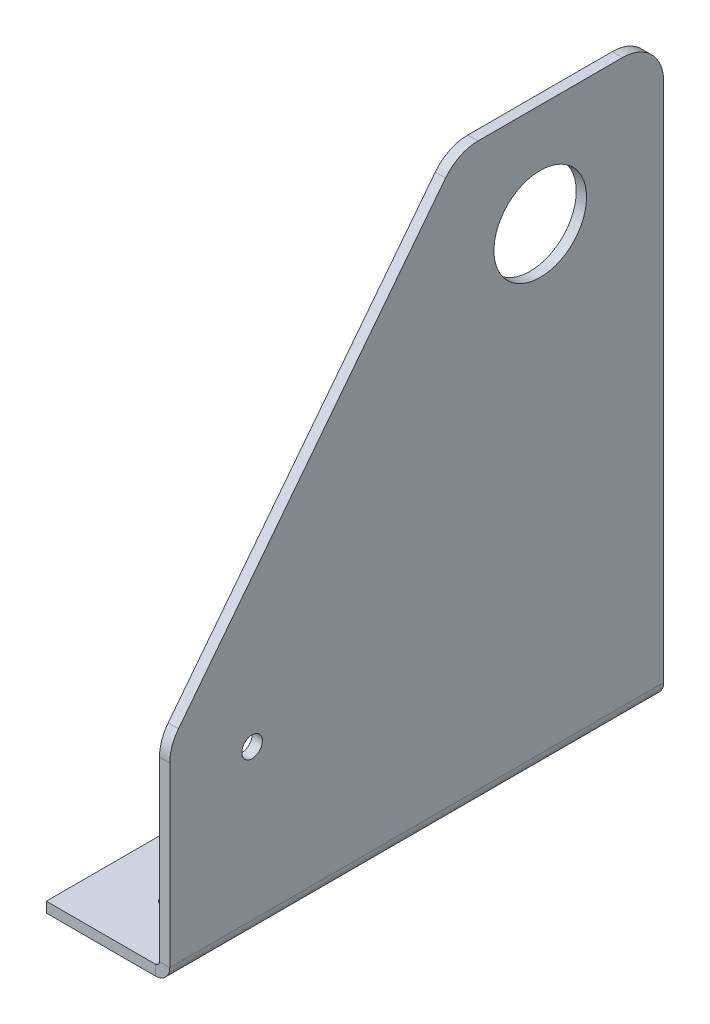
ISO-10303-21;
HEADER;
FILE_DESCRIPTION(('STEP AP214'),'2;1');
FILE_NAME('part.step','',(''),(''),'','','');
FILE_SCHEMA(('AUTOMOTIVE_DESIGN { 1 0 10303 214 1 1 1 1 }'));
ENDSEC;
DATA;
#1=APPLICATION_CONTEXT('core data for automotive mechanical design processes');
#2=APPLICATION_PROTOCOL_DEFINITION('international standard','automotive_design',2000,#1);
#3=PRODUCT_CONTEXT('',#1,'mechanical');
#4=PRODUCT('Part','Part','',(#3));
#5=PRODUCT_RELATED_PRODUCT_CATEGORY('part','',(#4));
#6=PRODUCT_DEFINITION_FORMATION('','',#4);
#7=PRODUCT_DEFINITION_CONTEXT('part definition',#1,'design');
#8=PRODUCT_DEFINITION('design','',#6,#7);
#9=PRODUCT_DEFINITION_SHAPE('','',#8);
#10=(LENGTH_UNIT() NAMED_UNIT(*) SI_UNIT(.MILLI.,.METRE.));
#11=(NAMED_UNIT(*) PLANE_ANGLE_UNIT() SI_UNIT($,.RADIAN.));
#12=(NAMED_UNIT(*) SI_UNIT($,.STERADIAN.) SOLID_ANGLE_UNIT());
#13=UNCERTAINTY_MEASURE_WITH_UNIT(LENGTH_MEASURE(1.E-05),#10,'distance_accuracy_value','');
#14=(GEOMETRIC_REPRESENTATION_CONTEXT(3) GLOBAL_UNCERTAINTY_ASSIGNED_CONTEXT((#13)) GLOBAL_UNIT_ASSIGNED_CONTEXT((#10,
#11,#12)) REPRESENTATION_CONTEXT('',''));
#15=CARTESIAN_POINT('',(0.,0.,0.));
#16=DIRECTION('',(0.,0.,1.));
#17=DIRECTION('',(1.,0.,0.));
#18=AXIS2_PLACEMENT_3D('',#15,#16,#17);
#19=CARTESIAN_POINT('',(-3.175,0.,76.2));
#20=DIRECTION('',(0.,0.,1.));
#21=DIRECTION('',(0.,-1.,0.));
#22=AXIS2_PLACEMENT_3D('',#19,#20,#21);
#23=PLANE('',#22);
#24=DIRECTION('',(-1.,0.,0.));
#25=VECTOR('',#24,1.);
#26=CARTESIAN_POINT('',(-3.175,4.44500000000002,76.2));
#27=LINE('',#26,#25);
#28=CARTESIAN_POINT('',(0.,4.44500000000001,76.2));
#29=VERTEX_POINT('',#28);
#30=CARTESIAN_POINT('',(-3.175,4.44500000000002,76.2));
#31=VERTEX_POINT('',#30);
#32=EDGE_CURVE('E11',#29,#31,#27,.T.);
#33=ORIENTED_EDGE('',*,*,#32,.F.);
#34=DIRECTION('',(0.,1.,0.));
#35=VECTOR('',#34,1.);
#36=CARTESIAN_POINT('',(0.,59.1425315732014,76.2));
#37=LINE('',#36,#35);
#38=CARTESIAN_POINT('',(0.,59.1425315732013,76.2));
#39=VERTEX_POINT('',#38);
#40=EDGE_CURVE('E97',#39,#29,#37,.F.);
#41=ORIENTED_EDGE('',*,*,#40,.F.);
#42=DIRECTION('',(-1.,0.,0.));
#43=VECTOR('',#42,1.);
#44=CARTESIAN_POINT('',(-3.175,59.1425315732013,76.2));
#45=LINE('',#44,#43);
#46=CARTESIAN_POINT('',(-3.175,59.1425315732013,76.2));
#47=VERTEX_POINT('',#46);
#48=EDGE_CURVE('E46',#39,#47,#45,.T.);
#49=ORIENTED_EDGE('',*,*,#48,.T.);
#50=DIRECTION('',(0.,-1.,0.));
#51=VECTOR('',#50,1.);
#52=CARTESIAN_POINT('',(-3.175,0.,76.2));
#53=LINE('',#52,#51);
#54=EDGE_CURVE('E99',#47,#31,#53,.T.);
#55=ORIENTED_EDGE('',*,*,#54,.T.);
#56=EDGE_LOOP('',(#33,#41,#49,#55));
#57=FACE_BOUND('',#56,.T.);
#58=ADVANCED_FACE('F36',(#57),#23,.T.);
#59=CARTESIAN_POINT('',(-3.175,59.1425315732014,63.5));
#60=DIRECTION('',(1.,0.,0.));
#61=DIRECTION('',(0.,0.,-1.));
#62=AXIS2_PLACEMENT_3D('',#59,#60,#61);
#63=CYLINDRICAL_SURFACE('',#62,12.7);
#64=ORIENTED_EDGE('',*,*,#48,.F.);
#65=CARTESIAN_POINT('',(0.,59.1425315732014,63.5));
#66=DIRECTION('',(1.,0.,0.));
#67=DIRECTION('',(0.,0.,-1.));
#68=AXIS2_PLACEMENT_3D('',#65,#66,#67);
#69=CIRCLE('',#68,12.7);
#70=CARTESIAN_POINT('',(0.,66.9395773648409,73.5247731606793));
#71=VERTEX_POINT('',#70);
#72=EDGE_CURVE('E124',#71,#39,#69,.T.);
#73=ORIENTED_EDGE('',*,*,#72,.F.);
#74=DIRECTION('',(-1.,0.,0.));
#75=VECTOR('',#74,1.);
#76=CARTESIAN_POINT('',(-3.175,66.9395773648409,73.5247731606793));
#77=LINE('',#76,#75);
#78=CARTESIAN_POINT('',(-3.175,66.9395773648409,73.5247731606793));
#79=VERTEX_POINT('',#78);
#80=EDGE_CURVE('E163',#71,#79,#77,.T.);
#81=ORIENTED_EDGE('',*,*,#80,.T.);
#82=CARTESIAN_POINT('',(-3.175,59.1425315732014,63.5));
#83=DIRECTION('',(1.,0.,0.));
#84=DIRECTION('',(0.,0.,-1.));
#85=AXIS2_PLACEMENT_3D('',#82,#83,#84);
#86=CIRCLE('',#85,12.7);
#87=EDGE_CURVE('E176',#79,#47,#86,.T.);
#88=ORIENTED_EDGE('',*,*,#87,.T.);
#89=EDGE_LOOP('',(#64,#73,#81,#88));
#90=FACE_BOUND('',#89,.T.);
#91=ADVANCED_FACE('F182',(#90),#63,.T.);
#92=CARTESIAN_POINT('',(-3.175,66.9395773648409,73.5247731606793));
#93=DIRECTION('',(0.,0.61394061351492,0.789352217376326));
#94=DIRECTION('',(0.,-0.789352217376326,0.61394061351492));
#95=AXIS2_PLACEMENT_3D('',#92,#93,#94);
#96=PLANE('',#95);
#97=ORIENTED_EDGE('',*,*,#80,.F.);
#98=DIRECTION('',(0.,-0.789352217376326,0.61394061351492));
#99=VECTOR('',#98,1.);
#100=CARTESIAN_POINT('',(0.,66.9395773648409,73.5247731606793));
#101=LINE('',#100,#99);
#102=CARTESIAN_POINT('',(0.,172.897045791639,-8.8865911712751));
#103=VERTEX_POINT('',#102);
#104=EDGE_CURVE('E252',#103,#71,#101,.T.);
#105=ORIENTED_EDGE('',*,*,#104,.F.);
#106=DIRECTION('',(-1.,0.,0.));
#107=VECTOR('',#106,1.);
#108=CARTESIAN_POINT('',(-3.175,172.897045791639,-8.8865911712751));
#109=LINE('',#108,#107);
#110=CARTESIAN_POINT('',(-3.175,172.897045791639,-8.8865911712751));
#111=VERTEX_POINT('',#110);
#112=EDGE_CURVE('E160',#103,#111,#109,.T.);
#113=ORIENTED_EDGE('',*,*,#112,.T.);
#114=DIRECTION('',(0.,-0.789352217376326,0.61394061351492));
#115=VECTOR('',#114,1.);
#116=CARTESIAN_POINT('',(-3.175,66.9395773648409,73.5247731606793));
#117=LINE('',#116,#115);
#118=EDGE_CURVE('E183',#111,#79,#117,.T.);
#119=ORIENTED_EDGE('',*,*,#118,.T.);
#120=EDGE_LOOP('',(#97,#105,#113,#119));
#121=FACE_BOUND('',#120,.T.);
#122=ADVANCED_FACE('F256',(#121),#96,.T.);
#123=CARTESIAN_POINT('',(-3.175,165.1,-18.9113643319545));
#124=DIRECTION('',(1.,0.,0.));
#125=DIRECTION('',(0.,0.,-1.));
#126=AXIS2_PLACEMENT_3D('',#123,#124,#125);
#127=CYLINDRICAL_SURFACE('',#126,12.7);
#128=ORIENTED_EDGE('',*,*,#112,.F.);
#129=CARTESIAN_POINT('',(0.,165.1,-18.9113643319545));
#130=DIRECTION('',(1.,0.,0.));
#131=DIRECTION('',(0.,0.,-1.));
#132=AXIS2_PLACEMENT_3D('',#129,#130,#131);
#133=CIRCLE('',#132,12.7);
#134=CARTESIAN_POINT('',(0.,177.8,-18.9113643319545));
#135=VERTEX_POINT('',#134);
#136=EDGE_CURVE('E249',#135,#103,#133,.T.);
#137=ORIENTED_EDGE('',*,*,#136,.F.);
#138=DIRECTION('',(-1.,0.,0.));
#139=VECTOR('',#138,1.);
#140=CARTESIAN_POINT('',(-3.175,177.8,-18.9113643319545));
#141=LINE('',#140,#139);
#142=CARTESIAN_POINT('',(-3.175,177.8,-18.9113643319545));
#143=VERTEX_POINT('',#142);
#144=EDGE_CURVE('E157',#135,#143,#141,.T.);
#145=ORIENTED_EDGE('',*,*,#144,.T.);
#146=CARTESIAN_POINT('',(-3.175,165.1,-18.9113643319545));
#147=DIRECTION('',(1.,0.,0.));
#148=DIRECTION('',(0.,0.,1.));
#149=AXIS2_PLACEMENT_3D('',#146,#147,#148);
#150=CIRCLE('',#149,12.7);
#151=EDGE_CURVE('E185',#143,#111,#150,.T.);
#152=ORIENTED_EDGE('',*,*,#151,.T.);
#153=EDGE_LOOP('',(#128,#137,#145,#152));
#154=FACE_BOUND('',#153,.T.);
#155=ADVANCED_FACE('F264',(#154),#127,.T.);
#156=CARTESIAN_POINT('',(-3.175,177.8,-18.9113643319545));
#157=DIRECTION('',(0.,1.,0.));
#158=DIRECTION('',(0.,0.,1.));
#159=AXIS2_PLACEMENT_3D('',#156,#157,#158);
#160=PLANE('',#159);
#161=ORIENTED_EDGE('',*,*,#144,.F.);
#162=DIRECTION('',(0.,0.,-1.));
#163=VECTOR('',#162,1.);
#164=CARTESIAN_POINT('',(0.,177.8,63.5));
#165=LINE('',#164,#163);
#166=CARTESIAN_POINT('',(0.,177.8,-63.4999999999999));
#167=VERTEX_POINT('',#166);
#168=EDGE_CURVE('E246',#167,#135,#165,.F.);
#169=ORIENTED_EDGE('',*,*,#168,.F.);
#170=DIRECTION('',(-1.,0.,0.));
#171=VECTOR('',#170,1.);
#172=CARTESIAN_POINT('',(-3.175,177.8,-63.4999999999999));
#173=LINE('',#172,#171);
#174=CARTESIAN_POINT('',(-3.175,177.8,-63.4999999999999));
#175=VERTEX_POINT('',#174);
#176=EDGE_CURVE('E154',#167,#175,#173,.T.);
#177=ORIENTED_EDGE('',*,*,#176,.T.);
#178=DIRECTION('',(0.,0.,1.));
#179=VECTOR('',#178,1.);
#180=CARTESIAN_POINT('',(-3.175,177.8,-18.9113643319545));
#181=LINE('',#180,#179);
#182=EDGE_CURVE('E191',#175,#143,#181,.T.);
#183=ORIENTED_EDGE('',*,*,#182,.T.);
#184=EDGE_LOOP('',(#161,#169,#177,#183));
#185=FACE_BOUND('',#184,.T.);
#186=ADVANCED_FACE('F269',(#185),#160,.T.);
#187=CARTESIAN_POINT('',(-3.175,165.1,-63.5));
#188=DIRECTION('',(1.,0.,0.));
#189=DIRECTION('',(0.,0.,-1.));
#190=AXIS2_PLACEMENT_3D('',#187,#188,#189);
#191=CYLINDRICAL_SURFACE('',#190,12.7);
#192=ORIENTED_EDGE('',*,*,#176,.F.);
#193=CARTESIAN_POINT('',(0.,165.1,-63.5));
#194=DIRECTION('',(1.,0.,0.));
#195=DIRECTION('',(0.,0.,-1.));
#196=AXIS2_PLACEMENT_3D('',#193,#194,#195);
#197=CIRCLE('',#196,12.7);
#198=CARTESIAN_POINT('',(0.,165.1,-76.1999999999999));
#199=VERTEX_POINT('',#198);
#200=EDGE_CURVE('E229',#199,#167,#197,.T.);
#201=ORIENTED_EDGE('',*,*,#200,.F.);
#202=DIRECTION('',(-1.,0.,0.));
#203=VECTOR('',#202,1.);
#204=CARTESIAN_POINT('',(-3.175,165.1,-76.2));
#205=LINE('',#204,#203);
#206=CARTESIAN_POINT('',(-3.175,165.1,-76.2));
#207=VERTEX_POINT('',#206);
#208=EDGE_CURVE('E151',#199,#207,#205,.T.);
#209=ORIENTED_EDGE('',*,*,#208,.T.);
#210=CARTESIAN_POINT('',(-3.175,165.1,-63.5));
#211=DIRECTION('',(1.,0.,0.));
#212=DIRECTION('',(0.,0.,-1.));
#213=AXIS2_PLACEMENT_3D('',#210,#211,#212);
#214=CIRCLE('',#213,12.7);
#215=EDGE_CURVE('E194',#207,#175,#214,.T.);
#216=ORIENTED_EDGE('',*,*,#215,.T.);
#217=EDGE_LOOP('',(#192,#201,#209,#216));
#218=FACE_BOUND('',#217,.T.);
#219=ADVANCED_FACE('F272',(#218),#191,.T.);
#220=CARTESIAN_POINT('',(-3.175,165.1,-76.2));
#221=DIRECTION('',(0.,0.,-1.));
#222=DIRECTION('',(0.,1.,0.));
#223=AXIS2_PLACEMENT_3D('',#220,#221,#222);
#224=PLANE('',#223);
#225=ORIENTED_EDGE('',*,*,#208,.F.);
#226=DIRECTION('',(0.,1.,0.));
#227=VECTOR('',#226,1.);
#228=CARTESIAN_POINT('',(0.,59.1425315732014,-76.2));
#229=LINE('',#228,#227);
#230=CARTESIAN_POINT('',(0.,4.44500000000003,-76.2));
#231=VERTEX_POINT('',#230);
#232=EDGE_CURVE('E125',#231,#199,#229,.T.);
#233=ORIENTED_EDGE('',*,*,#232,.F.);
#234=DIRECTION('',(-1.,0.,0.));
#235=VECTOR('',#234,1.);
#236=CARTESIAN_POINT('',(-3.175,4.44500000000003,-76.2));
#237=LINE('',#236,#235);
#238=CARTESIAN_POINT('',(-3.175,4.44500000000003,-76.2));
#239=VERTEX_POINT('',#238);
#240=EDGE_CURVE('E148',#231,#239,#237,.T.);
#241=ORIENTED_EDGE('',*,*,#240,.T.);
#242=DIRECTION('',(0.,1.,0.));
#243=VECTOR('',#242,1.);
#244=CARTESIAN_POINT('',(-3.175,165.1,-76.2));
#245=LINE('',#244,#243);
#246=EDGE_CURVE('E180',#239,#207,#245,.T.);
#247=ORIENTED_EDGE('',*,*,#246,.T.);
#248=EDGE_LOOP('',(#225,#233,#241,#247));
#249=FACE_BOUND('',#248,.T.);
#250=ADVANCED_FACE('F282',(#249),#224,.T.);
#251=CARTESIAN_POINT('',(-4.445,4.44500000000002,-76.2));
#252=DIRECTION('',(0.,0.,1.));
#253=DIRECTION('',(0.,-1.,0.));
#254=AXIS2_PLACEMENT_3D('',#251,#252,#253);
#255=PLANE('',#254);
#256=ORIENTED_EDGE('',*,*,#240,.F.);
#257=CARTESIAN_POINT('',(-4.445,4.44500000000002,-76.2));
#258=DIRECTION('',(0.,0.,1.));
#259=DIRECTION('',(1.,0.,0.));
#260=AXIS2_PLACEMENT_3D('',#257,#258,#259);
#261=CIRCLE('',#260,4.445);
#262=CARTESIAN_POINT('',(-4.44499999999999,0.,-76.2));
#263=VERTEX_POINT('',#262);
#264=EDGE_CURVE('E113',#231,#263,#261,.F.);
#265=ORIENTED_EDGE('',*,*,#264,.T.);
#266=DIRECTION('',(0.,1.,0.));
#267=VECTOR('',#266,1.);
#268=CARTESIAN_POINT('',(-4.445,3.17500000000002,-76.2));
#269=LINE('',#268,#267);
#270=CARTESIAN_POINT('',(-4.445,3.17500000000002,-76.2));
#271=VERTEX_POINT('',#270);
#272=EDGE_CURVE('E146',#263,#271,#269,.T.);
#273=ORIENTED_EDGE('',*,*,#272,.T.);
#274=CARTESIAN_POINT('',(-4.445,4.44500000000002,-76.2));
#275=DIRECTION('',(0.,0.,-1.));
#276=DIRECTION('',(0.,1.,0.));
#277=AXIS2_PLACEMENT_3D('',#274,#275,#276);
#278=CIRCLE('',#277,1.27);
#279=EDGE_CURVE('E220',#239,#271,#278,.T.);
#280=ORIENTED_EDGE('',*,*,#279,.F.);
#281=EDGE_LOOP('',(#256,#265,#273,#280));
#282=FACE_BOUND('',#281,.T.);
#283=ADVANCED_FACE('F343',(#282),#255,.F.);
#284=CARTESIAN_POINT('',(0.,3.17500000000002,-76.2));
#285=DIRECTION('',(0.,0.,-1.));
#286=DIRECTION('',(-1.,0.,0.));
#287=AXIS2_PLACEMENT_3D('',#284,#285,#286);
#288=PLANE('',#287);
#289=ORIENTED_EDGE('',*,*,#272,.F.);
#290=DIRECTION('',(-1.,0.,0.));
#291=VECTOR('',#290,1.);
#292=CARTESIAN_POINT('',(0.,0.,-76.2));
#293=LINE('',#292,#291);
#294=CARTESIAN_POINT('',(-38.1,0.,-76.2));
#295=VERTEX_POINT('',#294);
#296=EDGE_CURVE('E235',#263,#295,#293,.T.);
#297=ORIENTED_EDGE('',*,*,#296,.T.);
#298=DIRECTION('',(0.,1.,0.));
#299=VECTOR('',#298,1.);
#300=CARTESIAN_POINT('',(-38.1,3.17500000000002,-76.2));
#301=LINE('',#300,#299);
#302=CARTESIAN_POINT('',(-38.1,3.17500000000002,-76.2));
#303=VERTEX_POINT('',#302);
#304=EDGE_CURVE('E143',#295,#303,#301,.T.);
#305=ORIENTED_EDGE('',*,*,#304,.T.);
#306=DIRECTION('',(-1.,0.,0.));
#307=VECTOR('',#306,1.);
#308=CARTESIAN_POINT('',(0.,3.17500000000002,-76.2));
#309=LINE('',#308,#307);
#310=EDGE_CURVE('E206',#271,#303,#309,.T.);
#311=ORIENTED_EDGE('',*,*,#310,.F.);
#312=EDGE_LOOP('',(#289,#297,#305,#311));
#313=FACE_BOUND('',#312,.T.);
#314=ADVANCED_FACE('F339',(#313),#288,.T.);
#315=CARTESIAN_POINT('',(-38.1,3.17500000000002,-76.2));
#316=DIRECTION('',(-1.,0.,0.));
#317=DIRECTION('',(0.,0.,1.));
#318=AXIS2_PLACEMENT_3D('',#315,#316,#317);
#319=PLANE('',#318);
#320=ORIENTED_EDGE('',*,*,#304,.F.);
#321=DIRECTION('',(0.,0.,1.));
#322=VECTOR('',#321,1.);
#323=CARTESIAN_POINT('',(-38.1,0.,-76.2));
#324=LINE('',#323,#322);
#325=CARTESIAN_POINT('',(-38.1,0.,76.2));
#326=VERTEX_POINT('',#325);
#327=EDGE_CURVE('E238',#295,#326,#324,.T.);
#328=ORIENTED_EDGE('',*,*,#327,.T.);
#329=DIRECTION('',(0.,1.,0.));
#330=VECTOR('',#329,1.);
#331=CARTESIAN_POINT('',(-38.1,3.17500000000002,76.2));
#332=LINE('',#331,#330);
#333=CARTESIAN_POINT('',(-38.1,3.17500000000002,76.2));
#334=VERTEX_POINT('',#333);
#335=EDGE_CURVE('E140',#326,#334,#332,.T.);
#336=ORIENTED_EDGE('',*,*,#335,.T.);
#337=DIRECTION('',(0.,0.,1.));
#338=VECTOR('',#337,1.);
#339=CARTESIAN_POINT('',(-38.1,3.17500000000002,-76.2));
#340=LINE('',#339,#338);
#341=EDGE_CURVE('E209',#303,#334,#340,.T.);
#342=ORIENTED_EDGE('',*,*,#341,.F.);
#343=EDGE_LOOP('',(#320,#328,#336,#342));
#344=FACE_BOUND('',#343,.T.);
#345=ADVANCED_FACE('F309',(#344),#319,.T.);
#346=CARTESIAN_POINT('',(0.,3.17500000000002,76.2));
#347=DIRECTION('',(0.,0.,-1.));
#348=DIRECTION('',(-1.,0.,0.));
#349=AXIS2_PLACEMENT_3D('',#346,#347,#348);
#350=PLANE('',#349);
#351=ORIENTED_EDGE('',*,*,#335,.F.);
#352=DIRECTION('',(-1.,0.,0.));
#353=VECTOR('',#352,1.);
#354=CARTESIAN_POINT('',(0.,0.,76.2));
#355=LINE('',#354,#353);
#356=CARTESIAN_POINT('',(-4.445,0.,76.2));
#357=VERTEX_POINT('',#356);
#358=EDGE_CURVE('E118',#357,#326,#355,.T.);
#359=ORIENTED_EDGE('',*,*,#358,.F.);
#360=DIRECTION('',(0.,1.,0.));
#361=VECTOR('',#360,1.);
#362=CARTESIAN_POINT('',(-4.445,3.17500000000002,76.2));
#363=LINE('',#362,#361);
#364=CARTESIAN_POINT('',(-4.445,3.17500000000002,76.2));
#365=VERTEX_POINT('',#364);
#366=EDGE_CURVE('E40',#357,#365,#363,.T.);
#367=ORIENTED_EDGE('',*,*,#366,.T.);
#368=DIRECTION('',(-1.,0.,0.));
#369=VECTOR('',#368,1.);
#370=CARTESIAN_POINT('',(0.,3.17500000000002,76.2));
#371=LINE('',#370,#369);
#372=EDGE_CURVE('E212',#365,#334,#371,.T.);
#373=ORIENTED_EDGE('',*,*,#372,.T.);
#374=EDGE_LOOP('',(#351,#359,#367,#373));
#375=FACE_BOUND('',#374,.T.);
#376=ADVANCED_FACE('F300',(#375),#350,.F.);
#377=CARTESIAN_POINT('',(-3.175,146.05,-38.1));
#378=DIRECTION('',(1.,0.,0.));
#379=DIRECTION('',(0.,0.,-1.));
#380=AXIS2_PLACEMENT_3D('',#377,#378,#379);
#381=CYLINDRICAL_SURFACE('',#380,14.2875);
#382=CARTESIAN_POINT('',(-3.175,146.05,-38.1));
#383=DIRECTION('',(1.,0.,0.));
#384=DIRECTION('',(0.,0.,-1.));
#385=AXIS2_PLACEMENT_3D('',#382,#383,#384);
#386=CIRCLE('',#385,14.2875);
#387=CARTESIAN_POINT('',(-3.175,146.05,-52.3875));
#388=VERTEX_POINT('',#387);
#389=EDGE_CURVE('E223',#388,#388,#386,.T.);
#390=ORIENTED_EDGE('',*,*,#389,.F.);
#391=EDGE_LOOP('',(#390));
#392=FACE_BOUND('',#391,.T.);
#393=CARTESIAN_POINT('',(0.,146.05,-38.1));
#394=DIRECTION('',(1.,0.,0.));
#395=DIRECTION('',(0.,0.,-1.));
#396=AXIS2_PLACEMENT_3D('',#393,#394,#395);
#397=CIRCLE('',#396,14.2875);
#398=CARTESIAN_POINT('',(0.,146.05,-52.3875));
#399=VERTEX_POINT('',#398);
#400=EDGE_CURVE('E131',#399,#399,#397,.T.);
#401=ORIENTED_EDGE('',*,*,#400,.T.);
#402=EDGE_LOOP('',(#401));
#403=FACE_BOUND('',#402,.T.);
#404=ADVANCED_FACE('F38',(#392,#403),#381,.F.);
#405=CARTESIAN_POINT('',(-19.05,3.17500000000002,57.15));
#406=DIRECTION('',(0.,1.,0.));
#407=DIRECTION('',(-1.,0.,0.));
#408=AXIS2_PLACEMENT_3D('',#405,#406,#407);
#409=CYLINDRICAL_SURFACE('',#408,2.45745);
#410=CARTESIAN_POINT('',(-19.05,3.17500000000002,57.15));
#411=DIRECTION('',(0.,1.,0.));
#412=DIRECTION('',(-1.,0.,0.));
#413=AXIS2_PLACEMENT_3D('',#410,#411,#412);
#414=CIRCLE('',#413,2.45745);
#415=CARTESIAN_POINT('',(-21.50745,3.17500000000002,57.15));
#416=VERTEX_POINT('',#415);
#417=EDGE_CURVE('E197',#416,#416,#414,.T.);
#418=ORIENTED_EDGE('',*,*,#417,.T.);
#419=EDGE_LOOP('',(#418));
#420=FACE_BOUND('',#419,.T.);
#421=CARTESIAN_POINT('',(-19.05,0.,57.15));
#422=DIRECTION('',(0.,1.,0.));
#423=DIRECTION('',(-1.,0.,0.));
#424=AXIS2_PLACEMENT_3D('',#421,#422,#423);
#425=CIRCLE('',#424,2.45745);
#426=CARTESIAN_POINT('',(-21.50745,0.,57.15));
#427=VERTEX_POINT('',#426);
#428=EDGE_CURVE('E225',#427,#427,#425,.T.);
#429=ORIENTED_EDGE('',*,*,#428,.F.);
#430=EDGE_LOOP('',(#429));
#431=FACE_BOUND('',#430,.T.);
#432=ADVANCED_FACE('F299',(#420,#431),#409,.F.);
#433=CARTESIAN_POINT('',(-19.05,3.17500000000002,0.));
#434=DIRECTION('',(0.,1.,0.));
#435=DIRECTION('',(-1.,0.,0.));
#436=AXIS2_PLACEMENT_3D('',#433,#434,#435);
#437=CYLINDRICAL_SURFACE('',#436,2.45745);
#438=CARTESIAN_POINT('',(-19.05,3.17500000000002,0.));
#439=DIRECTION('',(0.,1.,0.));
#440=DIRECTION('',(-1.,0.,0.));
#441=AXIS2_PLACEMENT_3D('',#438,#439,#440);
#442=CIRCLE('',#441,2.45745);
#443=CARTESIAN_POINT('',(-21.50745,3.17500000000002,0.));
#444=VERTEX_POINT('',#443);
#445=EDGE_CURVE('E200',#444,#444,#442,.T.);
#446=ORIENTED_EDGE('',*,*,#445,.T.);
#447=EDGE_LOOP('',(#446));
#448=FACE_BOUND('',#447,.T.);
#449=CARTESIAN_POINT('',(-19.05,0.,0.));
#450=DIRECTION('',(0.,1.,0.));
#451=DIRECTION('',(-1.,0.,0.));
#452=AXIS2_PLACEMENT_3D('',#449,#450,#451);
#453=CIRCLE('',#452,2.45745);
#454=CARTESIAN_POINT('',(-21.50745,0.,0.));
#455=VERTEX_POINT('',#454);
#456=EDGE_CURVE('E228',#455,#455,#453,.T.);
#457=ORIENTED_EDGE('',*,*,#456,.F.);
#458=EDGE_LOOP('',(#457));
#459=FACE_BOUND('',#458,.T.);
#460=ADVANCED_FACE('F306',(#448,#459),#437,.F.);
#461=CARTESIAN_POINT('',(-19.05,3.17500000000002,-57.15));
#462=DIRECTION('',(0.,1.,0.));
#463=DIRECTION('',(-1.,0.,0.));
#464=AXIS2_PLACEMENT_3D('',#461,#462,#463);
#465=CYLINDRICAL_SURFACE('',#464,2.45745);
#466=CARTESIAN_POINT('',(-19.05,3.17500000000002,-57.15));
#467=DIRECTION('',(0.,1.,0.));
#468=DIRECTION('',(-1.,0.,0.));
#469=AXIS2_PLACEMENT_3D('',#466,#467,#468);
#470=CIRCLE('',#469,2.45745);
#471=CARTESIAN_POINT('',(-21.50745,3.17500000000002,-57.15));
#472=VERTEX_POINT('',#471);
#473=EDGE_CURVE('E203',#472,#472,#470,.T.);
#474=ORIENTED_EDGE('',*,*,#473,.T.);
#475=EDGE_LOOP('',(#474));
#476=FACE_BOUND('',#475,.T.);
#477=CARTESIAN_POINT('',(-19.05,0.,-57.15));
#478=DIRECTION('',(0.,1.,0.));
#479=DIRECTION('',(-1.,0.,0.));
#480=AXIS2_PLACEMENT_3D('',#477,#478,#479);
#481=CIRCLE('',#480,2.45745);
#482=CARTESIAN_POINT('',(-21.50745,0.,-57.15));
#483=VERTEX_POINT('',#482);
#484=EDGE_CURVE('E232',#483,#483,#481,.T.);
#485=ORIENTED_EDGE('',*,*,#484,.F.);
#486=EDGE_LOOP('',(#485));
#487=FACE_BOUND('',#486,.T.);
#488=ADVANCED_FACE('F321',(#476,#487),#465,.F.);
#489=CARTESIAN_POINT('',(-4.445,4.44500000000002,76.2));
#490=DIRECTION('',(0.,0.,1.));
#491=DIRECTION('',(0.,-1.,0.));
#492=AXIS2_PLACEMENT_3D('',#489,#490,#491);
#493=PLANE('',#492);
#494=CARTESIAN_POINT('',(-4.445,4.44500000000002,76.2));
#495=DIRECTION('',(0.,0.,1.));
#496=DIRECTION('',(1.,0.,0.));
#497=AXIS2_PLACEMENT_3D('',#494,#495,#496);
#498=CIRCLE('',#497,4.445);
#499=EDGE_CURVE('E111',#357,#29,#498,.T.);
#500=ORIENTED_EDGE('',*,*,#499,.T.);
#501=ORIENTED_EDGE('',*,*,#32,.T.);
#502=CARTESIAN_POINT('',(-4.445,4.44500000000002,76.2));
#503=DIRECTION('',(0.,0.,-1.));
#504=DIRECTION('',(0.,1.,0.));
#505=AXIS2_PLACEMENT_3D('',#502,#503,#504);
#506=CIRCLE('',#505,1.27);
#507=EDGE_CURVE('E218',#365,#31,#506,.F.);
#508=ORIENTED_EDGE('',*,*,#507,.F.);
#509=ORIENTED_EDGE('',*,*,#366,.F.);
#510=EDGE_LOOP('',(#500,#501,#508,#509));
#511=FACE_BOUND('',#510,.T.);
#512=ADVANCED_FACE('F127',(#511),#493,.T.);
#513=CARTESIAN_POINT('',(0.,3.17500000000002,-76.2));
#514=DIRECTION('',(0.,1.,0.));
#515=DIRECTION('',(-1.,0.,0.));
#516=AXIS2_PLACEMENT_3D('',#513,#514,#515);
#517=PLANE('',#516);
#518=ORIENTED_EDGE('',*,*,#417,.F.);
#519=EDGE_LOOP('',(#518));
#520=FACE_BOUND('',#519,.T.);
#521=ORIENTED_EDGE('',*,*,#445,.F.);
#522=EDGE_LOOP('',(#521));
#523=FACE_BOUND('',#522,.T.);
#524=ORIENTED_EDGE('',*,*,#473,.F.);
#525=EDGE_LOOP('',(#524));
#526=FACE_BOUND('',#525,.T.);
#527=ORIENTED_EDGE('',*,*,#372,.F.);
#528=DIRECTION('',(0.,0.,1.));
#529=VECTOR('',#528,1.);
#530=CARTESIAN_POINT('',(-4.445,3.17500000000002,-76.2));
#531=LINE('',#530,#529);
#532=EDGE_CURVE('E215',#365,#271,#531,.F.);
#533=ORIENTED_EDGE('',*,*,#532,.T.);
#534=ORIENTED_EDGE('',*,*,#310,.T.);
#535=ORIENTED_EDGE('',*,*,#341,.T.);
#536=EDGE_LOOP('',(#527,#533,#534,#535));
#537=FACE_BOUND('',#536,.T.);
#538=ADVANCED_FACE('F320',(#520,#523,#526,#537),#517,.T.);
#539=CARTESIAN_POINT('',(-3.175,59.1425315732014,63.5));
#540=DIRECTION('',(1.,0.,0.));
#541=DIRECTION('',(0.,0.,-1.));
#542=AXIS2_PLACEMENT_3D('',#539,#540,#541);
#543=PLANE('',#542);
#544=CARTESIAN_POINT('',(-3.175,50.8,50.8));
#545=DIRECTION('',(1.,0.,0.));
#546=DIRECTION('',(0.,0.,-1.));
#547=AXIS2_PLACEMENT_3D('',#544,#545,#546);
#548=CIRCLE('',#547,3.17500000000001);
#549=CARTESIAN_POINT('',(-3.175,50.8,47.625));
#550=VERTEX_POINT('',#549);
#551=EDGE_CURVE('E129',#550,#550,#548,.T.);
#552=ORIENTED_EDGE('',*,*,#551,.T.);
#553=EDGE_LOOP('',(#552));
#554=FACE_BOUND('',#553,.T.);
#555=ORIENTED_EDGE('',*,*,#389,.T.);
#556=EDGE_LOOP('',(#555));
#557=FACE_BOUND('',#556,.T.);
#558=ORIENTED_EDGE('',*,*,#246,.F.);
#559=DIRECTION('',(0.,0.,1.));
#560=VECTOR('',#559,1.);
#561=CARTESIAN_POINT('',(-3.175,4.44500000000002,63.5));
#562=LINE('',#561,#560);
#563=EDGE_CURVE('E179',#239,#31,#562,.T.);
#564=ORIENTED_EDGE('',*,*,#563,.T.);
#565=ORIENTED_EDGE('',*,*,#54,.F.);
#566=ORIENTED_EDGE('',*,*,#87,.F.);
#567=ORIENTED_EDGE('',*,*,#118,.F.);
#568=ORIENTED_EDGE('',*,*,#151,.F.);
#569=ORIENTED_EDGE('',*,*,#182,.F.);
#570=ORIENTED_EDGE('',*,*,#215,.F.);
#571=EDGE_LOOP('',(#558,#564,#565,#566,#567,#568,#569,#570));
#572=FACE_BOUND('',#571,.T.);
#573=ADVANCED_FACE('F174',(#554,#557,#572),#543,.F.);
#574=CARTESIAN_POINT('',(-4.445,4.44500000000002,63.5));
#575=DIRECTION('',(0.,0.,1.));
#576=DIRECTION('',(1.,0.,0.));
#577=AXIS2_PLACEMENT_3D('',#574,#575,#576);
#578=CYLINDRICAL_SURFACE('',#577,1.27);
#579=ORIENTED_EDGE('',*,*,#279,.T.);
#580=ORIENTED_EDGE('',*,*,#532,.F.);
#581=ORIENTED_EDGE('',*,*,#507,.T.);
#582=ORIENTED_EDGE('',*,*,#563,.F.);
#583=EDGE_LOOP('',(#579,#580,#581,#582));
#584=FACE_BOUND('',#583,.T.);
#585=ADVANCED_FACE('F436',(#584),#578,.F.);
#586=CARTESIAN_POINT('',(0.,0.,-76.2));
#587=DIRECTION('',(0.,1.,0.));
#588=DIRECTION('',(-1.,0.,0.));
#589=AXIS2_PLACEMENT_3D('',#586,#587,#588);
#590=PLANE('',#589);
#591=ORIENTED_EDGE('',*,*,#428,.T.);
#592=EDGE_LOOP('',(#591));
#593=FACE_BOUND('',#592,.T.);
#594=ORIENTED_EDGE('',*,*,#456,.T.);
#595=EDGE_LOOP('',(#594));
#596=FACE_BOUND('',#595,.T.);
#597=ORIENTED_EDGE('',*,*,#484,.T.);
#598=EDGE_LOOP('',(#597));
#599=FACE_BOUND('',#598,.T.);
#600=ORIENTED_EDGE('',*,*,#358,.T.);
#601=ORIENTED_EDGE('',*,*,#327,.F.);
#602=ORIENTED_EDGE('',*,*,#296,.F.);
#603=DIRECTION('',(0.,0.,1.));
#604=VECTOR('',#603,1.);
#605=CARTESIAN_POINT('',(-4.445,0.,-76.2));
#606=LINE('',#605,#604);
#607=EDGE_CURVE('E117',#357,#263,#606,.F.);
#608=ORIENTED_EDGE('',*,*,#607,.F.);
#609=EDGE_LOOP('',(#600,#601,#602,#608));
#610=FACE_BOUND('',#609,.T.);
#611=ADVANCED_FACE('F294',(#593,#596,#599,#610),#590,.F.);
#612=CARTESIAN_POINT('',(0.,59.1425315732014,63.5));
#613=DIRECTION('',(1.,0.,0.));
#614=DIRECTION('',(0.,0.,-1.));
#615=AXIS2_PLACEMENT_3D('',#612,#613,#614);
#616=PLANE('',#615);
#617=CARTESIAN_POINT('',(0.,50.8,50.8));
#618=DIRECTION('',(1.,0.,0.));
#619=DIRECTION('',(0.,0.,-1.));
#620=AXIS2_PLACEMENT_3D('',#617,#618,#619);
#621=CIRCLE('',#620,3.17500000000001);
#622=CARTESIAN_POINT('',(0.,50.8,47.625));
#623=VERTEX_POINT('',#622);
#624=EDGE_CURVE('E134',#623,#623,#621,.T.);
#625=ORIENTED_EDGE('',*,*,#624,.F.);
#626=EDGE_LOOP('',(#625));
#627=FACE_BOUND('',#626,.T.);
#628=ORIENTED_EDGE('',*,*,#400,.F.);
#629=EDGE_LOOP('',(#628));
#630=FACE_BOUND('',#629,.T.);
#631=ORIENTED_EDGE('',*,*,#232,.T.);
#632=ORIENTED_EDGE('',*,*,#200,.T.);
#633=ORIENTED_EDGE('',*,*,#168,.T.);
#634=ORIENTED_EDGE('',*,*,#136,.T.);
#635=ORIENTED_EDGE('',*,*,#104,.T.);
#636=ORIENTED_EDGE('',*,*,#72,.T.);
#637=ORIENTED_EDGE('',*,*,#40,.T.);
#638=DIRECTION('',(0.,0.,-1.));
#639=VECTOR('',#638,1.);
#640=CARTESIAN_POINT('',(0.,4.44500000000003,63.5));
#641=LINE('',#640,#639);
#642=EDGE_CURVE('E108',#231,#29,#641,.F.);
#643=ORIENTED_EDGE('',*,*,#642,.F.);
#644=EDGE_LOOP('',(#631,#632,#633,#634,#635,#636,#637,#643));
#645=FACE_BOUND('',#644,.T.);
#646=ADVANCED_FACE('F121',(#627,#630,#645),#616,.T.);
#647=CARTESIAN_POINT('',(-4.445,4.44500000000002,63.5));
#648=DIRECTION('',(0.,0.,1.));
#649=DIRECTION('',(1.,0.,0.));
#650=AXIS2_PLACEMENT_3D('',#647,#648,#649);
#651=CYLINDRICAL_SURFACE('',#650,4.445);
#652=ORIENTED_EDGE('',*,*,#264,.F.);
#653=ORIENTED_EDGE('',*,*,#642,.T.);
#654=ORIENTED_EDGE('',*,*,#499,.F.);
#655=ORIENTED_EDGE('',*,*,#607,.T.);
#656=EDGE_LOOP('',(#652,#653,#654,#655));
#657=FACE_BOUND('',#656,.T.);
#658=ADVANCED_FACE('F109',(#657),#651,.T.);
#659=CARTESIAN_POINT('',(-38.1,50.8,50.8));
#660=DIRECTION('',(1.,0.,0.));
#661=DIRECTION('',(0.,0.,-1.));
#662=AXIS2_PLACEMENT_3D('',#659,#660,#661);
#663=CYLINDRICAL_SURFACE('',#662,3.17500000000001);
#664=ORIENTED_EDGE('',*,*,#624,.T.);
#665=EDGE_LOOP('',(#664));
#666=FACE_BOUND('',#665,.T.);
#667=ORIENTED_EDGE('',*,*,#551,.F.);
#668=EDGE_LOOP('',(#667));
#669=FACE_BOUND('',#668,.T.);
#670=ADVANCED_FACE('F289',(#666,#669),#663,.F.);
#671=CLOSED_SHELL('',(#58,#91,#122,#155,#186,#219,#250,#283,#314,#345,#376,#404,#432,#460,#488,
#512,#538,#573,#585,#611,#646,#658,#670));
#672=MANIFOLD_SOLID_BREP('B2',#671);
#673=ADVANCED_BREP_SHAPE_REPRESENTATION('',(#18,#672),#14);
#674=SHAPE_DEFINITION_REPRESENTATION(#9,#673);
ENDSEC;
END-ISO-10303-21;
